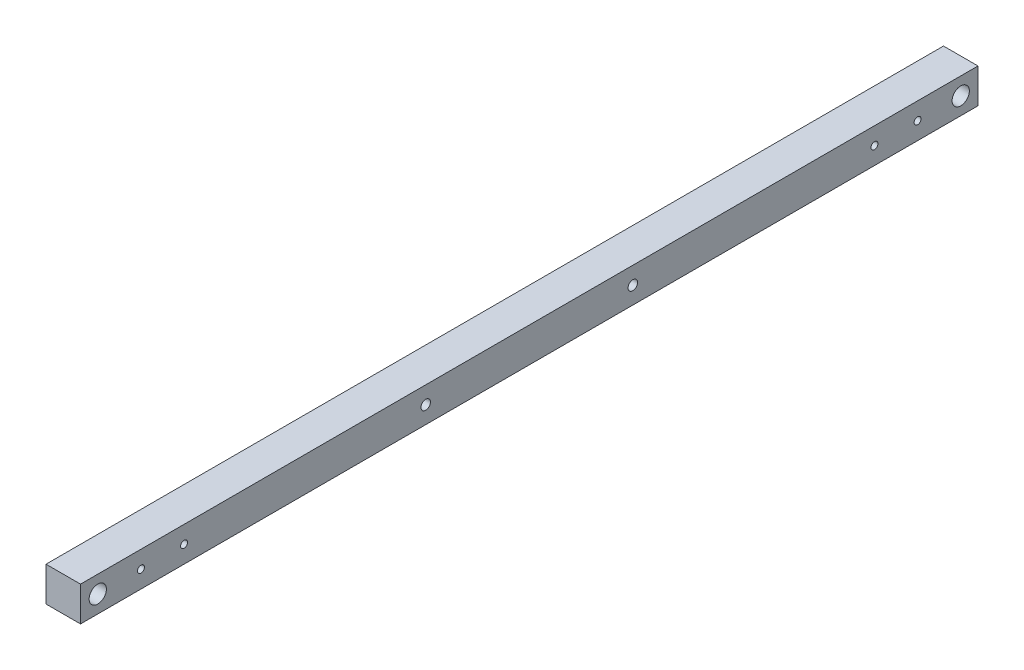
ISO-10303-21;
HEADER;
FILE_DESCRIPTION(('STEP AP214'),'2;1');
FILE_NAME('part.step','',(''),(''),'','','');
FILE_SCHEMA(('AUTOMOTIVE_DESIGN { 1 0 10303 214 1 1 1 1 }'));
ENDSEC;
DATA;
#1=APPLICATION_CONTEXT('core data for automotive mechanical design processes');
#2=APPLICATION_PROTOCOL_DEFINITION('international standard','automotive_design',2000,#1);
#3=PRODUCT_CONTEXT('',#1,'mechanical');
#4=PRODUCT('Part','Part','',(#3));
#5=PRODUCT_RELATED_PRODUCT_CATEGORY('part','',(#4));
#6=PRODUCT_DEFINITION_FORMATION('','',#4);
#7=PRODUCT_DEFINITION_CONTEXT('part definition',#1,'design');
#8=PRODUCT_DEFINITION('design','',#6,#7);
#9=PRODUCT_DEFINITION_SHAPE('','',#8);
#10=(LENGTH_UNIT() NAMED_UNIT(*) SI_UNIT(.MILLI.,.METRE.));
#11=(NAMED_UNIT(*) PLANE_ANGLE_UNIT() SI_UNIT($,.RADIAN.));
#12=(NAMED_UNIT(*) SI_UNIT($,.STERADIAN.) SOLID_ANGLE_UNIT());
#13=UNCERTAINTY_MEASURE_WITH_UNIT(LENGTH_MEASURE(1.E-05),#10,'distance_accuracy_value','');
#14=(GEOMETRIC_REPRESENTATION_CONTEXT(3) GLOBAL_UNCERTAINTY_ASSIGNED_CONTEXT((#13)) GLOBAL_UNIT_ASSIGNED_CONTEXT((#10,
#11,#12)) REPRESENTATION_CONTEXT('',''));
#15=CARTESIAN_POINT('',(0.,0.,0.));
#16=DIRECTION('',(0.,0.,1.));
#17=DIRECTION('',(1.,0.,0.));
#18=AXIS2_PLACEMENT_3D('',#15,#16,#17);
#19=CARTESIAN_POINT('',(12.7,-12.7,660.4));
#20=DIRECTION('',(-1.,0.,0.));
#21=DIRECTION('',(0.,0.,1.));
#22=AXIS2_PLACEMENT_3D('',#19,#20,#21);
#23=PLANE('',#22);
#24=CARTESIAN_POINT('',(12.7,0.,406.4));
#25=DIRECTION('',(-1.,0.,0.));
#26=DIRECTION('',(0.,0.,1.));
#27=AXIS2_PLACEMENT_3D('',#24,#25,#26);
#28=CIRCLE('',#27,3.50000000000002);
#29=CARTESIAN_POINT('',(12.7,0.,409.9));
#30=VERTEX_POINT('',#29);
#31=EDGE_CURVE('E157',#30,#30,#28,.T.);
#32=ORIENTED_EDGE('',*,*,#31,.T.);
#33=EDGE_LOOP('',(#32));
#34=FACE_BOUND('',#33,.T.);
#35=CARTESIAN_POINT('',(12.7,0.,254.));
#36=DIRECTION('',(-1.,0.,0.));
#37=DIRECTION('',(0.,0.,-1.));
#38=AXIS2_PLACEMENT_3D('',#35,#36,#37);
#39=CIRCLE('',#38,3.50000000000002);
#40=CARTESIAN_POINT('',(12.7,0.,250.5));
#41=VERTEX_POINT('',#40);
#42=EDGE_CURVE('E180',#41,#41,#39,.T.);
#43=ORIENTED_EDGE('',*,*,#42,.T.);
#44=EDGE_LOOP('',(#43));
#45=FACE_BOUND('',#44,.T.);
#46=CARTESIAN_POINT('',(12.7,0.,44.45));
#47=DIRECTION('',(-1.,0.,0.));
#48=DIRECTION('',(0.,0.,-1.));
#49=AXIS2_PLACEMENT_3D('',#46,#47,#48);
#50=CIRCLE('',#49,2.55000000000005);
#51=CARTESIAN_POINT('',(12.7,0.,41.8999999999999));
#52=VERTEX_POINT('',#51);
#53=EDGE_CURVE('E156',#52,#52,#50,.T.);
#54=ORIENTED_EDGE('',*,*,#53,.T.);
#55=EDGE_LOOP('',(#54));
#56=FACE_BOUND('',#55,.T.);
#57=CARTESIAN_POINT('',(12.7,0.,615.95));
#58=DIRECTION('',(-1.,0.,0.));
#59=DIRECTION('',(0.,0.,1.));
#60=AXIS2_PLACEMENT_3D('',#57,#58,#59);
#61=CIRCLE('',#60,2.55000000000005);
#62=CARTESIAN_POINT('',(12.7,0.,618.5));
#63=VERTEX_POINT('',#62);
#64=EDGE_CURVE('E165',#63,#63,#61,.T.);
#65=ORIENTED_EDGE('',*,*,#64,.T.);
#66=EDGE_LOOP('',(#65));
#67=FACE_BOUND('',#66,.T.);
#68=CARTESIAN_POINT('',(12.7,0.,76.2));
#69=DIRECTION('',(-1.,0.,0.));
#70=DIRECTION('',(0.,0.,-1.));
#71=AXIS2_PLACEMENT_3D('',#68,#69,#70);
#72=CIRCLE('',#71,2.55000000000005);
#73=CARTESIAN_POINT('',(12.7,0.,73.65));
#74=VERTEX_POINT('',#73);
#75=EDGE_CURVE('E148',#74,#74,#72,.T.);
#76=ORIENTED_EDGE('',*,*,#75,.T.);
#77=EDGE_LOOP('',(#76));
#78=FACE_BOUND('',#77,.T.);
#79=CARTESIAN_POINT('',(12.7,0.,584.2));
#80=DIRECTION('',(-1.,0.,0.));
#81=DIRECTION('',(0.,0.,1.));
#82=AXIS2_PLACEMENT_3D('',#79,#80,#81);
#83=CIRCLE('',#82,2.55000000000005);
#84=CARTESIAN_POINT('',(12.7,0.,586.75));
#85=VERTEX_POINT('',#84);
#86=EDGE_CURVE('E140',#85,#85,#83,.T.);
#87=ORIENTED_EDGE('',*,*,#86,.T.);
#88=EDGE_LOOP('',(#87));
#89=FACE_BOUND('',#88,.T.);
#90=CARTESIAN_POINT('',(12.7,0.,12.7));
#91=DIRECTION('',(1.,0.,0.));
#92=DIRECTION('',(0.,0.,-1.));
#93=AXIS2_PLACEMENT_3D('',#90,#91,#92);
#94=CIRCLE('',#93,6.35);
#95=CARTESIAN_POINT('',(12.7,0.,6.35));
#96=VERTEX_POINT('',#95);
#97=EDGE_CURVE('E134',#96,#96,#94,.T.);
#98=ORIENTED_EDGE('',*,*,#97,.F.);
#99=EDGE_LOOP('',(#98));
#100=FACE_BOUND('',#99,.T.);
#101=DIRECTION('',(0.,1.,0.));
#102=VECTOR('',#101,1.);
#103=CARTESIAN_POINT('',(12.7,-12.7,0.));
#104=LINE('',#103,#102);
#105=CARTESIAN_POINT('',(12.7,-12.7,0.));
#106=VERTEX_POINT('',#105);
#107=CARTESIAN_POINT('',(12.7,12.7,0.));
#108=VERTEX_POINT('',#107);
#109=EDGE_CURVE('E111',#106,#108,#104,.T.);
#110=ORIENTED_EDGE('',*,*,#109,.T.);
#111=DIRECTION('',(0.,0.,-1.));
#112=VECTOR('',#111,1.);
#113=CARTESIAN_POINT('',(12.7,12.7,660.4));
#114=LINE('',#113,#112);
#115=CARTESIAN_POINT('',(12.7,12.7,660.4));
#116=VERTEX_POINT('',#115);
#117=EDGE_CURVE('E11',#116,#108,#114,.T.);
#118=ORIENTED_EDGE('',*,*,#117,.F.);
#119=DIRECTION('',(0.,1.,0.));
#120=VECTOR('',#119,1.);
#121=CARTESIAN_POINT('',(12.7,-12.7,660.4));
#122=LINE('',#121,#120);
#123=CARTESIAN_POINT('',(12.7,-12.7,660.4));
#124=VERTEX_POINT('',#123);
#125=EDGE_CURVE('E93',#124,#116,#122,.T.);
#126=ORIENTED_EDGE('',*,*,#125,.F.);
#127=DIRECTION('',(0.,0.,-1.));
#128=VECTOR('',#127,1.);
#129=CARTESIAN_POINT('',(12.7,-12.7,660.4));
#130=LINE('',#129,#128);
#131=EDGE_CURVE('E107',#124,#106,#130,.T.);
#132=ORIENTED_EDGE('',*,*,#131,.T.);
#133=EDGE_LOOP('',(#110,#118,#126,#132));
#134=FACE_BOUND('',#133,.T.);
#135=CARTESIAN_POINT('',(12.7,0.,647.7));
#136=DIRECTION('',(-1.,0.,0.));
#137=DIRECTION('',(0.,0.,1.));
#138=AXIS2_PLACEMENT_3D('',#135,#136,#137);
#139=CIRCLE('',#138,6.34999999999994);
#140=CARTESIAN_POINT('',(12.7,0.,654.05));
#141=VERTEX_POINT('',#140);
#142=EDGE_CURVE('E127',#141,#141,#139,.T.);
#143=ORIENTED_EDGE('',*,*,#142,.T.);
#144=EDGE_LOOP('',(#143));
#145=FACE_BOUND('',#144,.T.);
#146=ADVANCED_FACE('F39',(#34,#45,#56,#67,#78,#89,#100,#134,#145),#23,.F.);
#147=CARTESIAN_POINT('',(-12.7,-12.7,660.4));
#148=DIRECTION('',(1.,0.,0.));
#149=DIRECTION('',(0.,0.,-1.));
#150=AXIS2_PLACEMENT_3D('',#147,#148,#149);
#151=PLANE('',#150);
#152=CARTESIAN_POINT('',(-12.7,0.,406.4));
#153=DIRECTION('',(-1.,0.,0.));
#154=DIRECTION('',(0.,0.,1.));
#155=AXIS2_PLACEMENT_3D('',#152,#153,#154);
#156=CIRCLE('',#155,3.50000000000002);
#157=CARTESIAN_POINT('',(-12.7,0.,409.9));
#158=VERTEX_POINT('',#157);
#159=EDGE_CURVE('E184',#158,#158,#156,.T.);
#160=ORIENTED_EDGE('',*,*,#159,.F.);
#161=EDGE_LOOP('',(#160));
#162=FACE_BOUND('',#161,.T.);
#163=CARTESIAN_POINT('',(-12.7,0.,254.));
#164=DIRECTION('',(-1.,0.,0.));
#165=DIRECTION('',(0.,0.,-1.));
#166=AXIS2_PLACEMENT_3D('',#163,#164,#165);
#167=CIRCLE('',#166,3.50000000000002);
#168=CARTESIAN_POINT('',(-12.7,0.,250.5));
#169=VERTEX_POINT('',#168);
#170=EDGE_CURVE('E176',#169,#169,#167,.T.);
#171=ORIENTED_EDGE('',*,*,#170,.F.);
#172=EDGE_LOOP('',(#171));
#173=FACE_BOUND('',#172,.T.);
#174=CARTESIAN_POINT('',(-12.7,0.,44.45));
#175=DIRECTION('',(-1.,0.,0.));
#176=DIRECTION('',(0.,0.,-1.));
#177=AXIS2_PLACEMENT_3D('',#174,#175,#176);
#178=CIRCLE('',#177,2.55000000000005);
#179=CARTESIAN_POINT('',(-12.7,0.,41.8999999999999));
#180=VERTEX_POINT('',#179);
#181=EDGE_CURVE('E152',#180,#180,#178,.T.);
#182=ORIENTED_EDGE('',*,*,#181,.F.);
#183=EDGE_LOOP('',(#182));
#184=FACE_BOUND('',#183,.T.);
#185=CARTESIAN_POINT('',(-12.7,0.,615.95));
#186=DIRECTION('',(-1.,0.,0.));
#187=DIRECTION('',(0.,0.,1.));
#188=AXIS2_PLACEMENT_3D('',#185,#186,#187);
#189=CIRCLE('',#188,2.55000000000005);
#190=CARTESIAN_POINT('',(-12.7,0.,618.5));
#191=VERTEX_POINT('',#190);
#192=EDGE_CURVE('E161',#191,#191,#189,.T.);
#193=ORIENTED_EDGE('',*,*,#192,.F.);
#194=EDGE_LOOP('',(#193));
#195=FACE_BOUND('',#194,.T.);
#196=CARTESIAN_POINT('',(-12.7,0.,76.2));
#197=DIRECTION('',(-1.,0.,0.));
#198=DIRECTION('',(0.,0.,-1.));
#199=AXIS2_PLACEMENT_3D('',#196,#197,#198);
#200=CIRCLE('',#199,2.55000000000005);
#201=CARTESIAN_POINT('',(-12.7,0.,73.65));
#202=VERTEX_POINT('',#201);
#203=EDGE_CURVE('E169',#202,#202,#200,.T.);
#204=ORIENTED_EDGE('',*,*,#203,.F.);
#205=EDGE_LOOP('',(#204));
#206=FACE_BOUND('',#205,.T.);
#207=CARTESIAN_POINT('',(-12.7,0.,584.2));
#208=DIRECTION('',(-1.,0.,0.));
#209=DIRECTION('',(0.,0.,1.));
#210=AXIS2_PLACEMENT_3D('',#207,#208,#209);
#211=CIRCLE('',#210,2.55000000000005);
#212=CARTESIAN_POINT('',(-12.7,0.,586.75));
#213=VERTEX_POINT('',#212);
#214=EDGE_CURVE('E143',#213,#213,#211,.T.);
#215=ORIENTED_EDGE('',*,*,#214,.F.);
#216=EDGE_LOOP('',(#215));
#217=FACE_BOUND('',#216,.T.);
#218=CARTESIAN_POINT('',(-12.7,0.,12.7));
#219=DIRECTION('',(1.,0.,0.));
#220=DIRECTION('',(0.,0.,-1.));
#221=AXIS2_PLACEMENT_3D('',#218,#219,#220);
#222=CIRCLE('',#221,6.35);
#223=CARTESIAN_POINT('',(-12.7,0.,6.35));
#224=VERTEX_POINT('',#223);
#225=EDGE_CURVE('E124',#224,#224,#222,.T.);
#226=ORIENTED_EDGE('',*,*,#225,.T.);
#227=EDGE_LOOP('',(#226));
#228=FACE_BOUND('',#227,.T.);
#229=DIRECTION('',(0.,-1.,0.));
#230=VECTOR('',#229,1.);
#231=CARTESIAN_POINT('',(-12.7,-12.7,0.));
#232=LINE('',#231,#230);
#233=CARTESIAN_POINT('',(-12.7,12.7,0.));
#234=VERTEX_POINT('',#233);
#235=CARTESIAN_POINT('',(-12.7,-12.7,0.));
#236=VERTEX_POINT('',#235);
#237=EDGE_CURVE('E75',#234,#236,#232,.T.);
#238=ORIENTED_EDGE('',*,*,#237,.T.);
#239=DIRECTION('',(0.,0.,-1.));
#240=VECTOR('',#239,1.);
#241=CARTESIAN_POINT('',(-12.7,-12.7,660.4));
#242=LINE('',#241,#240);
#243=CARTESIAN_POINT('',(-12.7,-12.7,660.4));
#244=VERTEX_POINT('',#243);
#245=EDGE_CURVE('E100',#244,#236,#242,.T.);
#246=ORIENTED_EDGE('',*,*,#245,.F.);
#247=DIRECTION('',(0.,-1.,0.));
#248=VECTOR('',#247,1.);
#249=CARTESIAN_POINT('',(-12.7,-12.7,660.4));
#250=LINE('',#249,#248);
#251=CARTESIAN_POINT('',(-12.7,12.7,660.4));
#252=VERTEX_POINT('',#251);
#253=EDGE_CURVE('E91',#252,#244,#250,.T.);
#254=ORIENTED_EDGE('',*,*,#253,.F.);
#255=DIRECTION('',(0.,0.,-1.));
#256=VECTOR('',#255,1.);
#257=CARTESIAN_POINT('',(-12.7,12.7,660.4));
#258=LINE('',#257,#256);
#259=EDGE_CURVE('E49',#252,#234,#258,.T.);
#260=ORIENTED_EDGE('',*,*,#259,.T.);
#261=EDGE_LOOP('',(#238,#246,#254,#260));
#262=FACE_BOUND('',#261,.T.);
#263=CARTESIAN_POINT('',(-12.7,0.,647.7));
#264=DIRECTION('',(1.,0.,0.));
#265=DIRECTION('',(0.,0.,-1.));
#266=AXIS2_PLACEMENT_3D('',#263,#264,#265);
#267=CIRCLE('',#266,6.34999999999994);
#268=CARTESIAN_POINT('',(-12.7,0.,641.35));
#269=VERTEX_POINT('',#268);
#270=EDGE_CURVE('E42',#269,#269,#267,.F.);
#271=ORIENTED_EDGE('',*,*,#270,.F.);
#272=EDGE_LOOP('',(#271));
#273=FACE_BOUND('',#272,.T.);
#274=ADVANCED_FACE('F102',(#162,#173,#184,#195,#206,#217,#228,#262,#273),#151,.F.);
#275=CARTESIAN_POINT('',(-12.7,12.7,660.4));
#276=DIRECTION('',(0.,-1.,0.));
#277=DIRECTION('',(0.,0.,-1.));
#278=AXIS2_PLACEMENT_3D('',#275,#276,#277);
#279=PLANE('',#278);
#280=DIRECTION('',(-1.,0.,0.));
#281=VECTOR('',#280,1.);
#282=CARTESIAN_POINT('',(-12.7,12.7,0.));
#283=LINE('',#282,#281);
#284=EDGE_CURVE('E98',#108,#234,#283,.T.);
#285=ORIENTED_EDGE('',*,*,#284,.T.);
#286=ORIENTED_EDGE('',*,*,#259,.F.);
#287=DIRECTION('',(-1.,0.,0.));
#288=VECTOR('',#287,1.);
#289=CARTESIAN_POINT('',(-12.7,12.7,660.4));
#290=LINE('',#289,#288);
#291=EDGE_CURVE('E88',#116,#252,#290,.T.);
#292=ORIENTED_EDGE('',*,*,#291,.F.);
#293=ORIENTED_EDGE('',*,*,#117,.T.);
#294=EDGE_LOOP('',(#285,#286,#292,#293));
#295=FACE_BOUND('',#294,.T.);
#296=ADVANCED_FACE('F97',(#295),#279,.F.);
#297=CARTESIAN_POINT('',(-12.7,-12.7,660.4));
#298=DIRECTION('',(0.,1.,0.));
#299=DIRECTION('',(0.,0.,1.));
#300=AXIS2_PLACEMENT_3D('',#297,#298,#299);
#301=PLANE('',#300);
#302=DIRECTION('',(1.,0.,0.));
#303=VECTOR('',#302,1.);
#304=CARTESIAN_POINT('',(-12.7,-12.7,0.));
#305=LINE('',#304,#303);
#306=EDGE_CURVE('E81',#236,#106,#305,.T.);
#307=ORIENTED_EDGE('',*,*,#306,.T.);
#308=ORIENTED_EDGE('',*,*,#131,.F.);
#309=DIRECTION('',(1.,0.,0.));
#310=VECTOR('',#309,1.);
#311=CARTESIAN_POINT('',(-12.7,-12.7,660.4));
#312=LINE('',#311,#310);
#313=EDGE_CURVE('E58',#244,#124,#312,.T.);
#314=ORIENTED_EDGE('',*,*,#313,.F.);
#315=ORIENTED_EDGE('',*,*,#245,.T.);
#316=EDGE_LOOP('',(#307,#308,#314,#315));
#317=FACE_BOUND('',#316,.T.);
#318=ADVANCED_FACE('F247',(#317),#301,.F.);
#319=CARTESIAN_POINT('',(0.,0.,660.4));
#320=DIRECTION('',(0.,0.,-1.));
#321=DIRECTION('',(-1.,0.,0.));
#322=AXIS2_PLACEMENT_3D('',#319,#320,#321);
#323=PLANE('',#322);
#324=ORIENTED_EDGE('',*,*,#125,.T.);
#325=ORIENTED_EDGE('',*,*,#291,.T.);
#326=ORIENTED_EDGE('',*,*,#253,.T.);
#327=ORIENTED_EDGE('',*,*,#313,.T.);
#328=EDGE_LOOP('',(#324,#325,#326,#327));
#329=FACE_BOUND('',#328,.T.);
#330=ADVANCED_FACE('F89',(#329),#323,.F.);
#331=CARTESIAN_POINT('',(0.,0.,0.));
#332=DIRECTION('',(0.,0.,-1.));
#333=DIRECTION('',(-1.,0.,0.));
#334=AXIS2_PLACEMENT_3D('',#331,#332,#333);
#335=PLANE('',#334);
#336=ORIENTED_EDGE('',*,*,#109,.F.);
#337=ORIENTED_EDGE('',*,*,#306,.F.);
#338=ORIENTED_EDGE('',*,*,#237,.F.);
#339=ORIENTED_EDGE('',*,*,#284,.F.);
#340=EDGE_LOOP('',(#336,#337,#338,#339));
#341=FACE_BOUND('',#340,.T.);
#342=ADVANCED_FACE('F259',(#341),#335,.T.);
#343=CARTESIAN_POINT('',(-12.700012,0.,12.7));
#344=DIRECTION('',(1.,0.,0.));
#345=DIRECTION('',(0.,0.,-1.));
#346=AXIS2_PLACEMENT_3D('',#343,#344,#345);
#347=CYLINDRICAL_SURFACE('',#346,6.35);
#348=ORIENTED_EDGE('',*,*,#97,.T.);
#349=EDGE_LOOP('',(#348));
#350=FACE_BOUND('',#349,.T.);
#351=ORIENTED_EDGE('',*,*,#225,.F.);
#352=EDGE_LOOP('',(#351));
#353=FACE_BOUND('',#352,.T.);
#354=ADVANCED_FACE('F227',(#350,#353),#347,.F.);
#355=CARTESIAN_POINT('',(-12.700012,0.,647.7));
#356=DIRECTION('',(1.,0.,0.));
#357=DIRECTION('',(0.,0.,-1.));
#358=AXIS2_PLACEMENT_3D('',#355,#356,#357);
#359=CYLINDRICAL_SURFACE('',#358,6.34999999999994);
#360=ORIENTED_EDGE('',*,*,#142,.F.);
#361=EDGE_LOOP('',(#360));
#362=FACE_BOUND('',#361,.T.);
#363=ORIENTED_EDGE('',*,*,#270,.T.);
#364=EDGE_LOOP('',(#363));
#365=FACE_BOUND('',#364,.T.);
#366=ADVANCED_FACE('F217',(#362,#365),#359,.F.);
#367=CARTESIAN_POINT('',(12.7,0.,584.2));
#368=DIRECTION('',(-1.,0.,0.));
#369=DIRECTION('',(0.,0.,1.));
#370=AXIS2_PLACEMENT_3D('',#367,#368,#369);
#371=CYLINDRICAL_SURFACE('',#370,2.55000000000005);
#372=ORIENTED_EDGE('',*,*,#86,.F.);
#373=EDGE_LOOP('',(#372));
#374=FACE_BOUND('',#373,.T.);
#375=ORIENTED_EDGE('',*,*,#214,.T.);
#376=EDGE_LOOP('',(#375));
#377=FACE_BOUND('',#376,.T.);
#378=ADVANCED_FACE('F214',(#374,#377),#371,.F.);
#379=CARTESIAN_POINT('',(12.7,0.,76.2));
#380=DIRECTION('',(-1.,0.,0.));
#381=DIRECTION('',(0.,0.,1.));
#382=AXIS2_PLACEMENT_3D('',#379,#380,#381);
#383=CYLINDRICAL_SURFACE('',#382,2.55000000000005);
#384=ORIENTED_EDGE('',*,*,#75,.F.);
#385=EDGE_LOOP('',(#384));
#386=FACE_BOUND('',#385,.T.);
#387=ORIENTED_EDGE('',*,*,#203,.T.);
#388=EDGE_LOOP('',(#387));
#389=FACE_BOUND('',#388,.T.);
#390=ADVANCED_FACE('F216',(#386,#389),#383,.F.);
#391=CARTESIAN_POINT('',(12.7,0.,615.95));
#392=DIRECTION('',(-1.,0.,0.));
#393=DIRECTION('',(0.,0.,1.));
#394=AXIS2_PLACEMENT_3D('',#391,#392,#393);
#395=CYLINDRICAL_SURFACE('',#394,2.55000000000005);
#396=ORIENTED_EDGE('',*,*,#64,.F.);
#397=EDGE_LOOP('',(#396));
#398=FACE_BOUND('',#397,.T.);
#399=ORIENTED_EDGE('',*,*,#192,.T.);
#400=EDGE_LOOP('',(#399));
#401=FACE_BOUND('',#400,.T.);
#402=ADVANCED_FACE('F224',(#398,#401),#395,.F.);
#403=CARTESIAN_POINT('',(12.7,0.,44.45));
#404=DIRECTION('',(-1.,0.,0.));
#405=DIRECTION('',(0.,0.,1.));
#406=AXIS2_PLACEMENT_3D('',#403,#404,#405);
#407=CYLINDRICAL_SURFACE('',#406,2.55000000000005);
#408=ORIENTED_EDGE('',*,*,#53,.F.);
#409=EDGE_LOOP('',(#408));
#410=FACE_BOUND('',#409,.T.);
#411=ORIENTED_EDGE('',*,*,#181,.T.);
#412=EDGE_LOOP('',(#411));
#413=FACE_BOUND('',#412,.T.);
#414=ADVANCED_FACE('F296',(#410,#413),#407,.F.);
#415=CARTESIAN_POINT('',(12.7,0.,254.));
#416=DIRECTION('',(-1.,0.,0.));
#417=DIRECTION('',(0.,0.,1.));
#418=AXIS2_PLACEMENT_3D('',#415,#416,#417);
#419=CYLINDRICAL_SURFACE('',#418,3.50000000000002);
#420=ORIENTED_EDGE('',*,*,#42,.F.);
#421=EDGE_LOOP('',(#420));
#422=FACE_BOUND('',#421,.T.);
#423=ORIENTED_EDGE('',*,*,#170,.T.);
#424=EDGE_LOOP('',(#423));
#425=FACE_BOUND('',#424,.T.);
#426=ADVANCED_FACE('F197',(#422,#425),#419,.F.);
#427=CARTESIAN_POINT('',(12.7,0.,406.4));
#428=DIRECTION('',(-1.,0.,0.));
#429=DIRECTION('',(0.,0.,1.));
#430=AXIS2_PLACEMENT_3D('',#427,#428,#429);
#431=CYLINDRICAL_SURFACE('',#430,3.50000000000002);
#432=ORIENTED_EDGE('',*,*,#31,.F.);
#433=EDGE_LOOP('',(#432));
#434=FACE_BOUND('',#433,.T.);
#435=ORIENTED_EDGE('',*,*,#159,.T.);
#436=EDGE_LOOP('',(#435));
#437=FACE_BOUND('',#436,.T.);
#438=ADVANCED_FACE('F194',(#434,#437),#431,.F.);
#439=CLOSED_SHELL('',(#146,#274,#296,#318,#330,#342,#354,#366,#378,#390,#402,#414,#426,#438));
#440=MANIFOLD_SOLID_BREP('B2',#439);
#441=ADVANCED_BREP_SHAPE_REPRESENTATION('',(#18,#440),#14);
#442=SHAPE_DEFINITION_REPRESENTATION(#9,#441);
ENDSEC;
END-ISO-10303-21;
